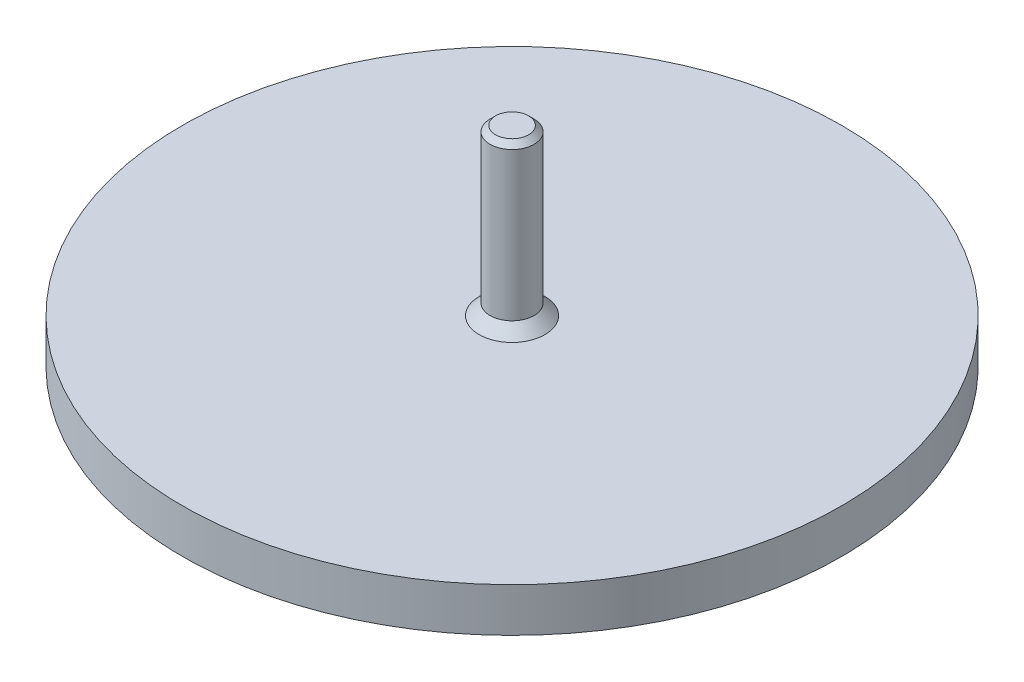
ISO-10303-21;
HEADER;
FILE_DESCRIPTION(('STEP AP214'),'2;1');
FILE_NAME('part.step','',(''),(''),'','','');
FILE_SCHEMA(('AUTOMOTIVE_DESIGN { 1 0 10303 214 1 1 1 1 }'));
ENDSEC;
DATA;
#1=APPLICATION_CONTEXT('core data for automotive mechanical design processes');
#2=APPLICATION_PROTOCOL_DEFINITION('international standard','automotive_design',2000,#1);
#3=PRODUCT_CONTEXT('',#1,'mechanical');
#4=PRODUCT('Part','Part','',(#3));
#5=PRODUCT_RELATED_PRODUCT_CATEGORY('part','',(#4));
#6=PRODUCT_DEFINITION_FORMATION('','',#4);
#7=PRODUCT_DEFINITION_CONTEXT('part definition',#1,'design');
#8=PRODUCT_DEFINITION('design','',#6,#7);
#9=PRODUCT_DEFINITION_SHAPE('','',#8);
#10=(LENGTH_UNIT() NAMED_UNIT(*) SI_UNIT(.MILLI.,.METRE.));
#11=(NAMED_UNIT(*) PLANE_ANGLE_UNIT() SI_UNIT($,.RADIAN.));
#12=(NAMED_UNIT(*) SI_UNIT($,.STERADIAN.) SOLID_ANGLE_UNIT());
#13=UNCERTAINTY_MEASURE_WITH_UNIT(LENGTH_MEASURE(1.E-05),#10,'distance_accuracy_value','');
#14=(GEOMETRIC_REPRESENTATION_CONTEXT(3) GLOBAL_UNCERTAINTY_ASSIGNED_CONTEXT((#13)) GLOBAL_UNIT_ASSIGNED_CONTEXT((#10,
#11,#12)) REPRESENTATION_CONTEXT('',''));
#15=CARTESIAN_POINT('',(0.,0.,0.));
#16=DIRECTION('',(0.,0.,1.));
#17=DIRECTION('',(1.,0.,0.));
#18=AXIS2_PLACEMENT_3D('',#15,#16,#17);
#19=CARTESIAN_POINT('',(0.,0.,0.));
#20=DIRECTION('',(0.,1.,0.));
#21=DIRECTION('',(0.,0.,1.));
#22=AXIS2_PLACEMENT_3D('',#19,#20,#21);
#23=PLANE('',#22);
#24=CARTESIAN_POINT('',(0.,0.,0.));
#25=DIRECTION('',(0.,-1.,0.));
#26=DIRECTION('',(0.,0.,-1.));
#27=AXIS2_PLACEMENT_3D('',#24,#25,#26);
#28=CIRCLE('',#27,30.);
#29=CARTESIAN_POINT('',(0.,0.,-30.));
#30=VERTEX_POINT('',#29);
#31=EDGE_CURVE('E48',#30,#30,#28,.T.);
#32=ORIENTED_EDGE('',*,*,#31,.T.);
#33=EDGE_LOOP('',(#32));
#34=FACE_BOUND('',#33,.T.);
#35=ADVANCED_FACE('F28',(#34),#23,.F.);
#36=CARTESIAN_POINT('',(0.,0.,0.));
#37=DIRECTION('',(0.,-1.,0.));
#38=DIRECTION('',(0.,0.,-1.));
#39=AXIS2_PLACEMENT_3D('',#36,#37,#38);
#40=CYLINDRICAL_SURFACE('',#39,30.);
#41=ORIENTED_EDGE('',*,*,#31,.F.);
#42=EDGE_LOOP('',(#41));
#43=FACE_BOUND('',#42,.T.);
#44=CARTESIAN_POINT('',(0.,4.,0.));
#45=DIRECTION('',(0.,-1.,0.));
#46=DIRECTION('',(0.,0.,-1.));
#47=AXIS2_PLACEMENT_3D('',#44,#45,#46);
#48=CIRCLE('',#47,30.);
#49=CARTESIAN_POINT('',(0.,4.,-30.));
#50=VERTEX_POINT('',#49);
#51=EDGE_CURVE('E51',#50,#50,#48,.T.);
#52=ORIENTED_EDGE('',*,*,#51,.T.);
#53=EDGE_LOOP('',(#52));
#54=FACE_BOUND('',#53,.T.);
#55=ADVANCED_FACE('F55',(#43,#54),#40,.T.);
#56=CARTESIAN_POINT('',(-30.,4.,0.));
#57=DIRECTION('',(0.,-1.,0.));
#58=DIRECTION('',(0.,0.,-1.));
#59=AXIS2_PLACEMENT_3D('',#56,#57,#58);
#60=PLANE('',#59);
#61=CARTESIAN_POINT('',(0.,4.,0.));
#62=DIRECTION('',(0.,-1.,0.));
#63=DIRECTION('',(0.,0.,-1.));
#64=AXIS2_PLACEMENT_3D('',#61,#62,#63);
#65=CIRCLE('',#64,2.99999999999998);
#66=CARTESIAN_POINT('',(0.,4.,-2.99999999999998));
#67=VERTEX_POINT('',#66);
#68=EDGE_CURVE('E43',#67,#67,#65,.T.);
#69=ORIENTED_EDGE('',*,*,#68,.T.);
#70=EDGE_LOOP('',(#69));
#71=FACE_BOUND('',#70,.T.);
#72=ORIENTED_EDGE('',*,*,#51,.F.);
#73=EDGE_LOOP('',(#72));
#74=FACE_BOUND('',#73,.T.);
#75=ADVANCED_FACE('F57',(#71,#74),#60,.F.);
#76=CARTESIAN_POINT('',(0.,0.,0.));
#77=DIRECTION('',(0.,-1.,0.));
#78=DIRECTION('',(0.,0.,-1.));
#79=AXIS2_PLACEMENT_3D('',#76,#77,#78);
#80=CYLINDRICAL_SURFACE('',#79,2.);
#81=CARTESIAN_POINT('',(0.,18.5,0.));
#82=DIRECTION('',(0.,-1.,0.));
#83=DIRECTION('',(0.,0.,-1.));
#84=AXIS2_PLACEMENT_3D('',#81,#82,#83);
#85=CIRCLE('',#84,2.);
#86=CARTESIAN_POINT('',(0.,18.5,-2.));
#87=VERTEX_POINT('',#86);
#88=EDGE_CURVE('E35',#87,#87,#85,.T.);
#89=ORIENTED_EDGE('',*,*,#88,.T.);
#90=EDGE_LOOP('',(#89));
#91=FACE_BOUND('',#90,.T.);
#92=CARTESIAN_POINT('',(0.,4.99999999999996,0.));
#93=DIRECTION('',(0.,-1.,0.));
#94=DIRECTION('',(0.,0.,-1.));
#95=AXIS2_PLACEMENT_3D('',#92,#93,#94);
#96=CIRCLE('',#95,2.);
#97=CARTESIAN_POINT('',(0.,4.99999999999996,-2.));
#98=VERTEX_POINT('',#97);
#99=EDGE_CURVE('E39',#98,#98,#96,.F.);
#100=ORIENTED_EDGE('',*,*,#99,.T.);
#101=EDGE_LOOP('',(#100));
#102=FACE_BOUND('',#101,.T.);
#103=ADVANCED_FACE('F59',(#91,#102),#80,.T.);
#104=CARTESIAN_POINT('',(-2.,19.,0.));
#105=DIRECTION('',(0.,-1.,0.));
#106=DIRECTION('',(0.,0.,-1.));
#107=AXIS2_PLACEMENT_3D('',#104,#105,#106);
#108=PLANE('',#107);
#109=CARTESIAN_POINT('',(0.,19.,0.));
#110=DIRECTION('',(0.,-1.,0.));
#111=DIRECTION('',(0.,0.,-1.));
#112=AXIS2_PLACEMENT_3D('',#109,#110,#111);
#113=CIRCLE('',#112,1.49999999999999);
#114=CARTESIAN_POINT('',(0.,19.,-1.49999999999999));
#115=VERTEX_POINT('',#114);
#116=EDGE_CURVE('E10',#115,#115,#113,.F.);
#117=ORIENTED_EDGE('',*,*,#116,.T.);
#118=EDGE_LOOP('',(#117));
#119=FACE_BOUND('',#118,.T.);
#120=ADVANCED_FACE('F66',(#119),#108,.F.);
#121=CARTESIAN_POINT('',(0.,4.,0.));
#122=DIRECTION('',(0.,-1.,0.));
#123=DIRECTION('',(0.,0.,-1.));
#124=AXIS2_PLACEMENT_3D('',#121,#122,#123);
#125=CONICAL_SURFACE('',#124,2.99999999999998,0.785398163397455);
#126=ORIENTED_EDGE('',*,*,#99,.F.);
#127=EDGE_LOOP('',(#126));
#128=FACE_BOUND('',#127,.T.);
#129=ORIENTED_EDGE('',*,*,#68,.F.);
#130=EDGE_LOOP('',(#129));
#131=FACE_BOUND('',#130,.T.);
#132=ADVANCED_FACE('F75',(#128,#131),#125,.T.);
#133=CARTESIAN_POINT('',(0.,18.5,0.));
#134=DIRECTION('',(0.,-1.,0.));
#135=DIRECTION('',(0.,0.,-1.));
#136=AXIS2_PLACEMENT_3D('',#133,#134,#135);
#137=CONICAL_SURFACE('',#136,2.,0.785398163397447);
#138=ORIENTED_EDGE('',*,*,#116,.F.);
#139=EDGE_LOOP('',(#138));
#140=FACE_BOUND('',#139,.T.);
#141=ORIENTED_EDGE('',*,*,#88,.F.);
#142=EDGE_LOOP('',(#141));
#143=FACE_BOUND('',#142,.T.);
#144=ADVANCED_FACE('F30',(#140,#143),#137,.T.);
#145=CLOSED_SHELL('',(#35,#55,#75,#103,#120,#132,#144));
#146=MANIFOLD_SOLID_BREP('B2',#145);
#147=ADVANCED_BREP_SHAPE_REPRESENTATION('',(#18,#146),#14);
#148=SHAPE_DEFINITION_REPRESENTATION(#9,#147);
ENDSEC;
END-ISO-10303-21;
